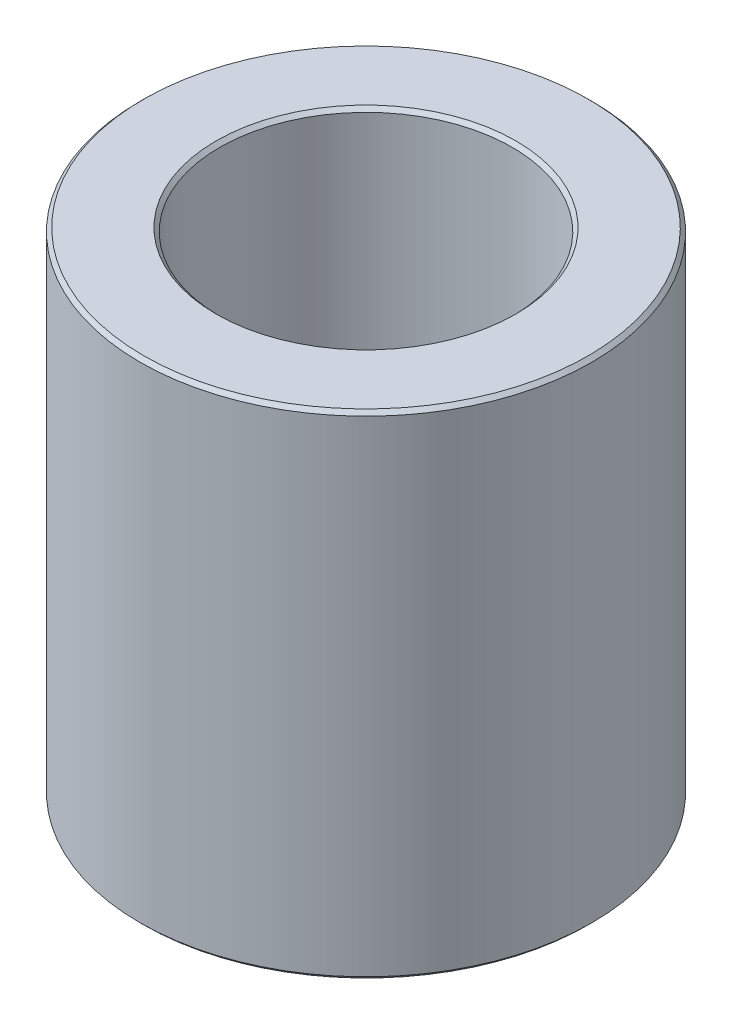
ISO-10303-21;
HEADER;
FILE_DESCRIPTION(('STEP AP214'),'2;1');
FILE_NAME('part.step','',(''),(''),'','','');
FILE_SCHEMA(('AUTOMOTIVE_DESIGN { 1 0 10303 214 1 1 1 1 }'));
ENDSEC;
DATA;
#1=APPLICATION_CONTEXT('core data for automotive mechanical design processes');
#2=APPLICATION_PROTOCOL_DEFINITION('international standard','automotive_design',2000,#1);
#3=PRODUCT_CONTEXT('',#1,'mechanical');
#4=PRODUCT('Part','Part','',(#3));
#5=PRODUCT_RELATED_PRODUCT_CATEGORY('part','',(#4));
#6=PRODUCT_DEFINITION_FORMATION('','',#4);
#7=PRODUCT_DEFINITION_CONTEXT('part definition',#1,'design');
#8=PRODUCT_DEFINITION('design','',#6,#7);
#9=PRODUCT_DEFINITION_SHAPE('','',#8);
#10=(LENGTH_UNIT() NAMED_UNIT(*) SI_UNIT(.MILLI.,.METRE.));
#11=(NAMED_UNIT(*) PLANE_ANGLE_UNIT() SI_UNIT($,.RADIAN.));
#12=(NAMED_UNIT(*) SI_UNIT($,.STERADIAN.) SOLID_ANGLE_UNIT());
#13=UNCERTAINTY_MEASURE_WITH_UNIT(LENGTH_MEASURE(1.E-05),#10,'distance_accuracy_value','');
#14=(GEOMETRIC_REPRESENTATION_CONTEXT(3) GLOBAL_UNCERTAINTY_ASSIGNED_CONTEXT((#13)) GLOBAL_UNIT_ASSIGNED_CONTEXT((#10,
#11,#12)) REPRESENTATION_CONTEXT('',''));
#15=CARTESIAN_POINT('',(0.,0.,0.));
#16=DIRECTION('',(0.,0.,1.));
#17=DIRECTION('',(1.,0.,0.));
#18=AXIS2_PLACEMENT_3D('',#15,#16,#17);
#19=CARTESIAN_POINT('',(0.,59.9859876800574,0.));
#20=DIRECTION('',(0.,-1.,0.));
#21=DIRECTION('',(0.,0.,-1.));
#22=AXIS2_PLACEMENT_3D('',#19,#20,#21);
#23=CYLINDRICAL_SURFACE('',#22,27.5);
#24=CARTESIAN_POINT('',(0.,0.450641966145367,0.));
#25=DIRECTION('',(0.,1.,0.));
#26=DIRECTION('',(0.,0.,1.));
#27=AXIS2_PLACEMENT_3D('',#24,#25,#26);
#28=CIRCLE('',#27,27.5);
#29=CARTESIAN_POINT('',(0.,0.450641966145367,27.5));
#30=VERTEX_POINT('',#29);
#31=EDGE_CURVE('E10',#30,#30,#28,.T.);
#32=ORIENTED_EDGE('',*,*,#31,.T.);
#33=EDGE_LOOP('',(#32));
#34=FACE_BOUND('',#33,.T.);
#35=CARTESIAN_POINT('',(0.,59.535345713912,0.));
#36=DIRECTION('',(0.,1.,0.));
#37=DIRECTION('',(0.,0.,1.));
#38=AXIS2_PLACEMENT_3D('',#35,#36,#37);
#39=CIRCLE('',#38,27.5);
#40=CARTESIAN_POINT('',(0.,59.535345713912,27.5));
#41=VERTEX_POINT('',#40);
#42=EDGE_CURVE('E50',#41,#41,#39,.F.);
#43=ORIENTED_EDGE('',*,*,#42,.T.);
#44=EDGE_LOOP('',(#43));
#45=FACE_BOUND('',#44,.T.);
#46=ADVANCED_FACE('F39',(#34,#45),#23,.T.);
#47=CARTESIAN_POINT('',(0.,59.9859876800574,0.));
#48=DIRECTION('',(0.,1.,0.));
#49=DIRECTION('',(0.,0.,1.));
#50=AXIS2_PLACEMENT_3D('',#47,#48,#49);
#51=PLANE('',#50);
#52=CARTESIAN_POINT('',(0.,59.9859876800574,0.));
#53=DIRECTION('',(0.,1.,0.));
#54=DIRECTION('',(0.,0.,1.));
#55=AXIS2_PLACEMENT_3D('',#52,#53,#54);
#56=CIRCLE('',#55,18.2497980287878);
#57=CARTESIAN_POINT('',(0.,59.9859876800574,18.2497980287878));
#58=VERTEX_POINT('',#57);
#59=EDGE_CURVE('E58',#58,#58,#56,.F.);
#60=ORIENTED_EDGE('',*,*,#59,.T.);
#61=EDGE_LOOP('',(#60));
#62=FACE_BOUND('',#61,.T.);
#63=CARTESIAN_POINT('',(0.,59.9859876800574,0.));
#64=DIRECTION('',(0.,1.,0.));
#65=DIRECTION('',(0.,0.,1.));
#66=AXIS2_PLACEMENT_3D('',#63,#64,#65);
#67=CIRCLE('',#66,27.0493580338546);
#68=CARTESIAN_POINT('',(0.,59.9859876800574,27.0493580338546));
#69=VERTEX_POINT('',#68);
#70=EDGE_CURVE('E61',#69,#69,#67,.T.);
#71=ORIENTED_EDGE('',*,*,#70,.T.);
#72=EDGE_LOOP('',(#71));
#73=FACE_BOUND('',#72,.T.);
#74=ADVANCED_FACE('F88',(#62,#73),#51,.T.);
#75=CARTESIAN_POINT('',(0.,0.,0.));
#76=DIRECTION('',(0.,1.,0.));
#77=DIRECTION('',(0.,0.,1.));
#78=AXIS2_PLACEMENT_3D('',#75,#76,#77);
#79=PLANE('',#78);
#80=CARTESIAN_POINT('',(0.,0.,0.));
#81=DIRECTION('',(0.,1.,0.));
#82=DIRECTION('',(0.,0.,1.));
#83=AXIS2_PLACEMENT_3D('',#80,#81,#82);
#84=CIRCLE('',#83,18.2497980287878);
#85=CARTESIAN_POINT('',(0.,0.,18.2497980287878));
#86=VERTEX_POINT('',#85);
#87=EDGE_CURVE('E51',#86,#86,#84,.T.);
#88=ORIENTED_EDGE('',*,*,#87,.T.);
#89=EDGE_LOOP('',(#88));
#90=FACE_BOUND('',#89,.T.);
#91=CARTESIAN_POINT('',(0.,0.,0.));
#92=DIRECTION('',(0.,1.,0.));
#93=DIRECTION('',(0.,0.,1.));
#94=AXIS2_PLACEMENT_3D('',#91,#92,#93);
#95=CIRCLE('',#94,27.0493580338546);
#96=CARTESIAN_POINT('',(0.,0.,27.0493580338546));
#97=VERTEX_POINT('',#96);
#98=EDGE_CURVE('E54',#97,#97,#95,.F.);
#99=ORIENTED_EDGE('',*,*,#98,.T.);
#100=EDGE_LOOP('',(#99));
#101=FACE_BOUND('',#100,.T.);
#102=ADVANCED_FACE('F83',(#90,#101),#79,.F.);
#103=CARTESIAN_POINT('',(0.,59.9859876800574,0.));
#104=DIRECTION('',(0.,-1.,0.));
#105=DIRECTION('',(0.,0.,-1.));
#106=AXIS2_PLACEMENT_3D('',#103,#104,#105);
#107=CYLINDRICAL_SURFACE('',#106,17.7991560626424);
#108=CARTESIAN_POINT('',(0.,59.535345713912,0.));
#109=DIRECTION('',(0.,1.,0.));
#110=DIRECTION('',(0.,0.,1.));
#111=AXIS2_PLACEMENT_3D('',#108,#109,#110);
#112=CIRCLE('',#111,17.7991560626424);
#113=CARTESIAN_POINT('',(0.,59.535345713912,17.7991560626424));
#114=VERTEX_POINT('',#113);
#115=EDGE_CURVE('E67',#114,#114,#112,.T.);
#116=ORIENTED_EDGE('',*,*,#115,.T.);
#117=EDGE_LOOP('',(#116));
#118=FACE_BOUND('',#117,.T.);
#119=CARTESIAN_POINT('',(0.,0.450641966145374,0.));
#120=DIRECTION('',(0.,1.,0.));
#121=DIRECTION('',(0.,0.,1.));
#122=AXIS2_PLACEMENT_3D('',#119,#120,#121);
#123=CIRCLE('',#122,17.7991560626424);
#124=CARTESIAN_POINT('',(0.,0.450641966145374,17.7991560626424));
#125=VERTEX_POINT('',#124);
#126=EDGE_CURVE('E69',#125,#125,#123,.F.);
#127=ORIENTED_EDGE('',*,*,#126,.T.);
#128=EDGE_LOOP('',(#127));
#129=FACE_BOUND('',#128,.T.);
#130=ADVANCED_FACE('F71',(#118,#129),#107,.F.);
#131=CARTESIAN_POINT('',(0.,59.535345713912,0.));
#132=DIRECTION('',(0.,1.,0.));
#133=DIRECTION('',(0.,0.,1.));
#134=AXIS2_PLACEMENT_3D('',#131,#132,#133);
#135=CONICAL_SURFACE('',#134,17.7991560626424,0.785398163397448);
#136=ORIENTED_EDGE('',*,*,#59,.F.);
#137=EDGE_LOOP('',(#136));
#138=FACE_BOUND('',#137,.T.);
#139=ORIENTED_EDGE('',*,*,#115,.F.);
#140=EDGE_LOOP('',(#139));
#141=FACE_BOUND('',#140,.T.);
#142=ADVANCED_FACE('F77',(#138,#141),#135,.F.);
#143=CARTESIAN_POINT('',(0.,0.,0.));
#144=DIRECTION('',(0.,-1.,0.));
#145=DIRECTION('',(0.,0.,-1.));
#146=AXIS2_PLACEMENT_3D('',#143,#144,#145);
#147=CONICAL_SURFACE('',#146,18.2497980287878,0.785398163397448);
#148=ORIENTED_EDGE('',*,*,#126,.F.);
#149=EDGE_LOOP('',(#148));
#150=FACE_BOUND('',#149,.T.);
#151=ORIENTED_EDGE('',*,*,#87,.F.);
#152=EDGE_LOOP('',(#151));
#153=FACE_BOUND('',#152,.T.);
#154=ADVANCED_FACE('F73',(#150,#153),#147,.F.);
#155=CARTESIAN_POINT('',(0.,0.450641966145367,0.));
#156=DIRECTION('',(0.,1.,0.));
#157=DIRECTION('',(0.,0.,1.));
#158=AXIS2_PLACEMENT_3D('',#155,#156,#157);
#159=CONICAL_SURFACE('',#158,27.5,0.785398163397452);
#160=ORIENTED_EDGE('',*,*,#98,.F.);
#161=EDGE_LOOP('',(#160));
#162=FACE_BOUND('',#161,.T.);
#163=ORIENTED_EDGE('',*,*,#31,.F.);
#164=EDGE_LOOP('',(#163));
#165=FACE_BOUND('',#164,.T.);
#166=ADVANCED_FACE('F76',(#162,#165),#159,.T.);
#167=CARTESIAN_POINT('',(0.,59.9859876800574,0.));
#168=DIRECTION('',(0.,-1.,0.));
#169=DIRECTION('',(0.,0.,-1.));
#170=AXIS2_PLACEMENT_3D('',#167,#168,#169);
#171=CONICAL_SURFACE('',#170,27.0493580338546,0.785398163397441);
#172=ORIENTED_EDGE('',*,*,#42,.F.);
#173=EDGE_LOOP('',(#172));
#174=FACE_BOUND('',#173,.T.);
#175=ORIENTED_EDGE('',*,*,#70,.F.);
#176=EDGE_LOOP('',(#175));
#177=FACE_BOUND('',#176,.T.);
#178=ADVANCED_FACE('F45',(#174,#177),#171,.T.);
#179=CLOSED_SHELL('',(#46,#74,#102,#130,#142,#154,#166,#178));
#180=MANIFOLD_SOLID_BREP('B2',#179);
#181=ADVANCED_BREP_SHAPE_REPRESENTATION('',(#18,#180),#14);
#182=SHAPE_DEFINITION_REPRESENTATION(#9,#181);
ENDSEC;
END-ISO-10303-21;
